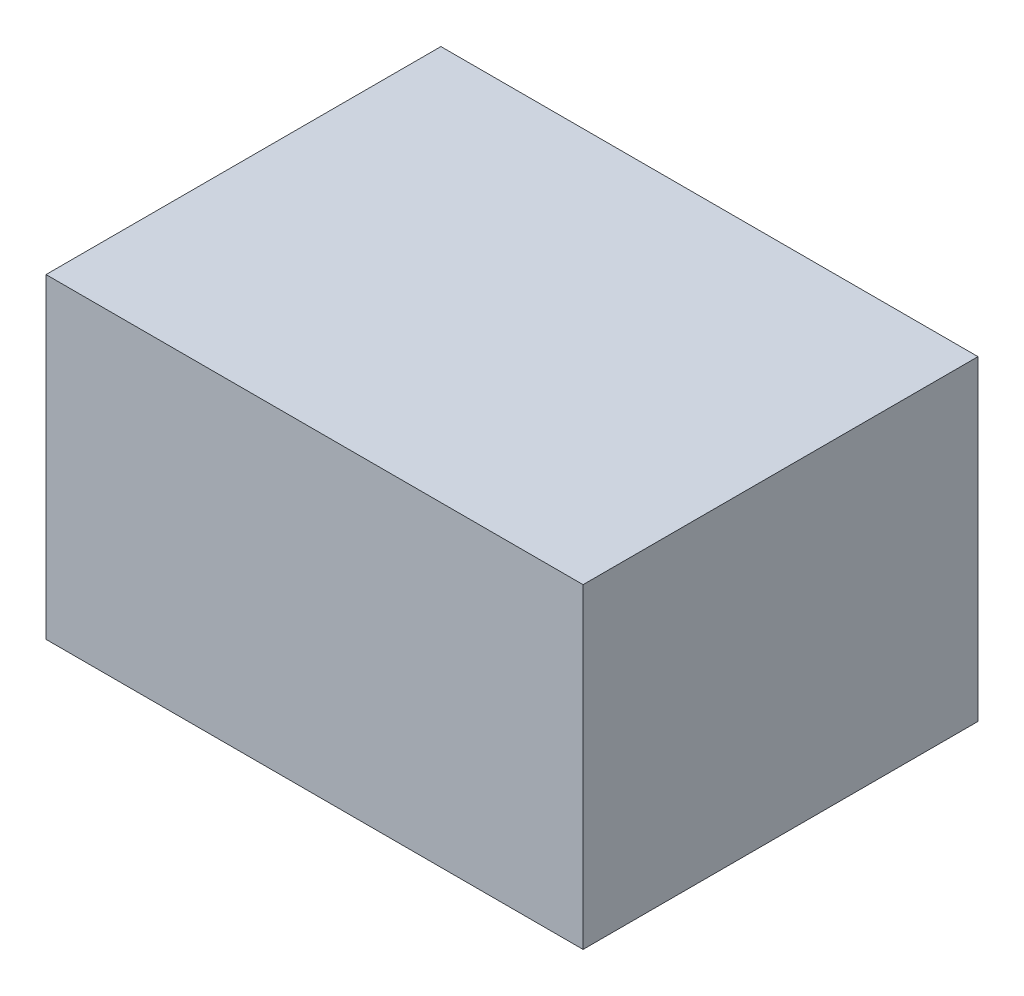
ISO-10303-21;
HEADER;
FILE_DESCRIPTION(('STEP AP214'),'2;1');
FILE_NAME('part.step','',(''),(''),'','','');
FILE_SCHEMA(('AUTOMOTIVE_DESIGN { 1 0 10303 214 1 1 1 1 }'));
ENDSEC;
DATA;
#1=APPLICATION_CONTEXT('core data for automotive mechanical design processes');
#2=APPLICATION_PROTOCOL_DEFINITION('international standard','automotive_design',2000,#1);
#3=PRODUCT_CONTEXT('',#1,'mechanical');
#4=PRODUCT('Part','Part','',(#3));
#5=PRODUCT_RELATED_PRODUCT_CATEGORY('part','',(#4));
#6=PRODUCT_DEFINITION_FORMATION('','',#4);
#7=PRODUCT_DEFINITION_CONTEXT('part definition',#1,'design');
#8=PRODUCT_DEFINITION('design','',#6,#7);
#9=PRODUCT_DEFINITION_SHAPE('','',#8);
#10=(LENGTH_UNIT() NAMED_UNIT(*) SI_UNIT(.MILLI.,.METRE.));
#11=(NAMED_UNIT(*) PLANE_ANGLE_UNIT() SI_UNIT($,.RADIAN.));
#12=(NAMED_UNIT(*) SI_UNIT($,.STERADIAN.) SOLID_ANGLE_UNIT());
#13=UNCERTAINTY_MEASURE_WITH_UNIT(LENGTH_MEASURE(1.E-05),#10,'distance_accuracy_value','');
#14=(GEOMETRIC_REPRESENTATION_CONTEXT(3) GLOBAL_UNCERTAINTY_ASSIGNED_CONTEXT((#13)) GLOBAL_UNIT_ASSIGNED_CONTEXT((#10,
#11,#12)) REPRESENTATION_CONTEXT('',''));
#15=CARTESIAN_POINT('',(0.,0.,0.));
#16=DIRECTION('',(0.,0.,1.));
#17=DIRECTION('',(1.,0.,0.));
#18=AXIS2_PLACEMENT_3D('',#15,#16,#17);
#19=CARTESIAN_POINT('',(0.,200.,0.));
#20=DIRECTION('',(1.,0.,0.));
#21=DIRECTION('',(0.,0.,-1.));
#22=AXIS2_PLACEMENT_3D('',#19,#20,#21);
#23=PLANE('',#22);
#24=DIRECTION('',(0.,0.,1.));
#25=VECTOR('',#24,1.);
#26=CARTESIAN_POINT('',(0.,0.,0.));
#27=LINE('',#26,#25);
#28=CARTESIAN_POINT('',(0.,0.,-250.));
#29=VERTEX_POINT('',#28);
#30=CARTESIAN_POINT('',(0.,0.,0.));
#31=VERTEX_POINT('',#30);
#32=EDGE_CURVE('E96',#29,#31,#27,.T.);
#33=ORIENTED_EDGE('',*,*,#32,.T.);
#34=DIRECTION('',(0.,-1.,0.));
#35=VECTOR('',#34,1.);
#36=CARTESIAN_POINT('',(0.,200.,0.));
#37=LINE('',#36,#35);
#38=CARTESIAN_POINT('',(0.,200.,0.));
#39=VERTEX_POINT('',#38);
#40=EDGE_CURVE('E11',#39,#31,#37,.T.);
#41=ORIENTED_EDGE('',*,*,#40,.F.);
#42=DIRECTION('',(0.,0.,1.));
#43=VECTOR('',#42,1.);
#44=CARTESIAN_POINT('',(0.,200.,0.));
#45=LINE('',#44,#43);
#46=CARTESIAN_POINT('',(0.,200.,-250.));
#47=VERTEX_POINT('',#46);
#48=EDGE_CURVE('E84',#47,#39,#45,.T.);
#49=ORIENTED_EDGE('',*,*,#48,.F.);
#50=DIRECTION('',(0.,-1.,0.));
#51=VECTOR('',#50,1.);
#52=CARTESIAN_POINT('',(0.,200.,-250.));
#53=LINE('',#52,#51);
#54=EDGE_CURVE('E92',#47,#29,#53,.T.);
#55=ORIENTED_EDGE('',*,*,#54,.T.);
#56=EDGE_LOOP('',(#33,#41,#49,#55));
#57=FACE_BOUND('',#56,.T.);
#58=ADVANCED_FACE('F33',(#57),#23,.F.);
#59=CARTESIAN_POINT('',(0.,200.,0.));
#60=DIRECTION('',(0.,0.,-1.));
#61=DIRECTION('',(-1.,0.,0.));
#62=AXIS2_PLACEMENT_3D('',#59,#60,#61);
#63=PLANE('',#62);
#64=DIRECTION('',(1.,0.,0.));
#65=VECTOR('',#64,1.);
#66=CARTESIAN_POINT('',(0.,0.,0.));
#67=LINE('',#66,#65);
#68=CARTESIAN_POINT('',(340.,0.,0.));
#69=VERTEX_POINT('',#68);
#70=EDGE_CURVE('E88',#31,#69,#67,.T.);
#71=ORIENTED_EDGE('',*,*,#70,.T.);
#72=DIRECTION('',(0.,-1.,0.));
#73=VECTOR('',#72,1.);
#74=CARTESIAN_POINT('',(340.,200.,0.));
#75=LINE('',#74,#73);
#76=CARTESIAN_POINT('',(340.,200.,0.));
#77=VERTEX_POINT('',#76);
#78=EDGE_CURVE('E41',#77,#69,#75,.T.);
#79=ORIENTED_EDGE('',*,*,#78,.F.);
#80=DIRECTION('',(1.,0.,0.));
#81=VECTOR('',#80,1.);
#82=CARTESIAN_POINT('',(0.,200.,0.));
#83=LINE('',#82,#81);
#84=EDGE_CURVE('E79',#39,#77,#83,.T.);
#85=ORIENTED_EDGE('',*,*,#84,.F.);
#86=ORIENTED_EDGE('',*,*,#40,.T.);
#87=EDGE_LOOP('',(#71,#79,#85,#86));
#88=FACE_BOUND('',#87,.T.);
#89=ADVANCED_FACE('F87',(#88),#63,.F.);
#90=CARTESIAN_POINT('',(340.,200.,0.));
#91=DIRECTION('',(-1.,0.,0.));
#92=DIRECTION('',(0.,0.,1.));
#93=AXIS2_PLACEMENT_3D('',#90,#91,#92);
#94=PLANE('',#93);
#95=DIRECTION('',(0.,0.,-1.));
#96=VECTOR('',#95,1.);
#97=CARTESIAN_POINT('',(340.,0.,0.));
#98=LINE('',#97,#96);
#99=CARTESIAN_POINT('',(340.,0.,-250.));
#100=VERTEX_POINT('',#99);
#101=EDGE_CURVE('E66',#69,#100,#98,.T.);
#102=ORIENTED_EDGE('',*,*,#101,.T.);
#103=DIRECTION('',(0.,-1.,0.));
#104=VECTOR('',#103,1.);
#105=CARTESIAN_POINT('',(340.,200.,-250.));
#106=LINE('',#105,#104);
#107=CARTESIAN_POINT('',(340.,200.,-250.));
#108=VERTEX_POINT('',#107);
#109=EDGE_CURVE('E89',#108,#100,#106,.T.);
#110=ORIENTED_EDGE('',*,*,#109,.F.);
#111=DIRECTION('',(0.,0.,-1.));
#112=VECTOR('',#111,1.);
#113=CARTESIAN_POINT('',(340.,200.,0.));
#114=LINE('',#113,#112);
#115=EDGE_CURVE('E82',#77,#108,#114,.T.);
#116=ORIENTED_EDGE('',*,*,#115,.F.);
#117=ORIENTED_EDGE('',*,*,#78,.T.);
#118=EDGE_LOOP('',(#102,#110,#116,#117));
#119=FACE_BOUND('',#118,.T.);
#120=ADVANCED_FACE('F90',(#119),#94,.F.);
#121=CARTESIAN_POINT('',(0.,200.,-250.));
#122=DIRECTION('',(0.,0.,1.));
#123=DIRECTION('',(1.,0.,0.));
#124=AXIS2_PLACEMENT_3D('',#121,#122,#123);
#125=PLANE('',#124);
#126=DIRECTION('',(-1.,0.,0.));
#127=VECTOR('',#126,1.);
#128=CARTESIAN_POINT('',(0.,0.,-250.));
#129=LINE('',#128,#127);
#130=EDGE_CURVE('E72',#100,#29,#129,.T.);
#131=ORIENTED_EDGE('',*,*,#130,.T.);
#132=ORIENTED_EDGE('',*,*,#54,.F.);
#133=DIRECTION('',(-1.,0.,0.));
#134=VECTOR('',#133,1.);
#135=CARTESIAN_POINT('',(0.,200.,-250.));
#136=LINE('',#135,#134);
#137=EDGE_CURVE('E49',#108,#47,#136,.T.);
#138=ORIENTED_EDGE('',*,*,#137,.F.);
#139=ORIENTED_EDGE('',*,*,#109,.T.);
#140=EDGE_LOOP('',(#131,#132,#138,#139));
#141=FACE_BOUND('',#140,.T.);
#142=ADVANCED_FACE('F103',(#141),#125,.F.);
#143=CARTESIAN_POINT('',(0.,200.,0.));
#144=DIRECTION('',(0.,-1.,0.));
#145=DIRECTION('',(0.,0.,-1.));
#146=AXIS2_PLACEMENT_3D('',#143,#144,#145);
#147=PLANE('',#146);
#148=ORIENTED_EDGE('',*,*,#48,.T.);
#149=ORIENTED_EDGE('',*,*,#84,.T.);
#150=ORIENTED_EDGE('',*,*,#115,.T.);
#151=ORIENTED_EDGE('',*,*,#137,.T.);
#152=EDGE_LOOP('',(#148,#149,#150,#151));
#153=FACE_BOUND('',#152,.T.);
#154=ADVANCED_FACE('F80',(#153),#147,.F.);
#155=CARTESIAN_POINT('',(0.,0.,0.));
#156=DIRECTION('',(0.,-1.,0.));
#157=DIRECTION('',(0.,0.,-1.));
#158=AXIS2_PLACEMENT_3D('',#155,#156,#157);
#159=PLANE('',#158);
#160=ORIENTED_EDGE('',*,*,#32,.F.);
#161=ORIENTED_EDGE('',*,*,#130,.F.);
#162=ORIENTED_EDGE('',*,*,#101,.F.);
#163=ORIENTED_EDGE('',*,*,#70,.F.);
#164=EDGE_LOOP('',(#160,#161,#162,#163));
#165=FACE_BOUND('',#164,.T.);
#166=ADVANCED_FACE('F106',(#165),#159,.T.);
#167=CLOSED_SHELL('',(#58,#89,#120,#142,#154,#166));
#168=MANIFOLD_SOLID_BREP('B2',#167);
#169=ADVANCED_BREP_SHAPE_REPRESENTATION('',(#18,#168),#14);
#170=SHAPE_DEFINITION_REPRESENTATION(#9,#169);
ENDSEC;
END-ISO-10303-21;
